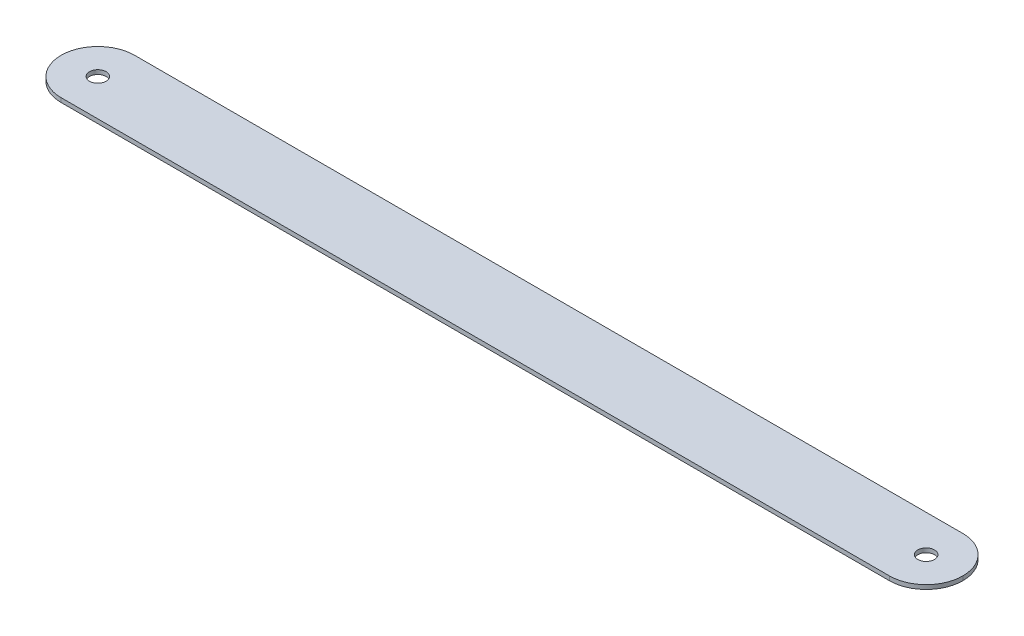
ISO-10303-21;
HEADER;
FILE_DESCRIPTION(('STEP AP214'),'2;1');
FILE_NAME('part.step','',(''),(''),'','','');
FILE_SCHEMA(('AUTOMOTIVE_DESIGN { 1 0 10303 214 1 1 1 1 }'));
ENDSEC;
DATA;
#1=APPLICATION_CONTEXT('core data for automotive mechanical design processes');
#2=APPLICATION_PROTOCOL_DEFINITION('international standard','automotive_design',2000,#1);
#3=PRODUCT_CONTEXT('',#1,'mechanical');
#4=PRODUCT('Part','Part','',(#3));
#5=PRODUCT_RELATED_PRODUCT_CATEGORY('part','',(#4));
#6=PRODUCT_DEFINITION_FORMATION('','',#4);
#7=PRODUCT_DEFINITION_CONTEXT('part definition',#1,'design');
#8=PRODUCT_DEFINITION('design','',#6,#7);
#9=PRODUCT_DEFINITION_SHAPE('','',#8);
#10=(LENGTH_UNIT() NAMED_UNIT(*) SI_UNIT(.MILLI.,.METRE.));
#11=(NAMED_UNIT(*) PLANE_ANGLE_UNIT() SI_UNIT($,.RADIAN.));
#12=(NAMED_UNIT(*) SI_UNIT($,.STERADIAN.) SOLID_ANGLE_UNIT());
#13=UNCERTAINTY_MEASURE_WITH_UNIT(LENGTH_MEASURE(1.E-05),#10,'distance_accuracy_value','');
#14=(GEOMETRIC_REPRESENTATION_CONTEXT(3) GLOBAL_UNCERTAINTY_ASSIGNED_CONTEXT((#13)) GLOBAL_UNIT_ASSIGNED_CONTEXT((#10,
#11,#12)) REPRESENTATION_CONTEXT('',''));
#15=CARTESIAN_POINT('',(0.,0.,0.));
#16=DIRECTION('',(0.,0.,1.));
#17=DIRECTION('',(1.,0.,0.));
#18=AXIS2_PLACEMENT_3D('',#15,#16,#17);
#19=CARTESIAN_POINT('',(92.075,-0.86,-7.50000000000001));
#20=DIRECTION('',(0.,0.,-1.));
#21=DIRECTION('',(-1.,0.,0.));
#22=AXIS2_PLACEMENT_3D('',#19,#20,#21);
#23=PLANE('',#22);
#24=DIRECTION('',(-1.,0.,0.));
#25=VECTOR('',#24,1.);
#26=CARTESIAN_POINT('',(92.075,0.,-7.50000000000001));
#27=LINE('',#26,#25);
#28=CARTESIAN_POINT('',(84.575,0.,-7.50000000000001));
#29=VERTEX_POINT('',#28);
#30=CARTESIAN_POINT('',(-84.575,0.,-7.49999999999999));
#31=VERTEX_POINT('',#30);
#32=EDGE_CURVE('E112',#29,#31,#27,.T.);
#33=ORIENTED_EDGE('',*,*,#32,.F.);
#34=DIRECTION('',(0.,1.,0.));
#35=VECTOR('',#34,1.);
#36=CARTESIAN_POINT('',(84.575,-0.86,-7.50000000000001));
#37=LINE('',#36,#35);
#38=CARTESIAN_POINT('',(84.575,-0.86,-7.50000000000001));
#39=VERTEX_POINT('',#38);
#40=EDGE_CURVE('E11',#29,#39,#37,.F.);
#41=ORIENTED_EDGE('',*,*,#40,.T.);
#42=DIRECTION('',(-1.,0.,0.));
#43=VECTOR('',#42,1.);
#44=CARTESIAN_POINT('',(92.075,-0.86,-7.50000000000001));
#45=LINE('',#44,#43);
#46=CARTESIAN_POINT('',(-84.575,-0.86,-7.49999999999999));
#47=VERTEX_POINT('',#46);
#48=EDGE_CURVE('E117',#39,#47,#45,.T.);
#49=ORIENTED_EDGE('',*,*,#48,.T.);
#50=DIRECTION('',(0.,1.,0.));
#51=VECTOR('',#50,1.);
#52=CARTESIAN_POINT('',(-84.575,-0.86,-7.49999999999999));
#53=LINE('',#52,#51);
#54=EDGE_CURVE('E45',#47,#31,#53,.T.);
#55=ORIENTED_EDGE('',*,*,#54,.T.);
#56=EDGE_LOOP('',(#33,#41,#49,#55));
#57=FACE_BOUND('',#56,.T.);
#58=ADVANCED_FACE('F36',(#57),#23,.T.);
#59=CARTESIAN_POINT('',(92.075,-0.86,7.49999999999999));
#60=DIRECTION('',(0.,0.,1.));
#61=DIRECTION('',(1.,0.,0.));
#62=AXIS2_PLACEMENT_3D('',#59,#60,#61);
#63=PLANE('',#62);
#64=DIRECTION('',(1.,0.,0.));
#65=VECTOR('',#64,1.);
#66=CARTESIAN_POINT('',(92.075,-0.86,7.49999999999999));
#67=LINE('',#66,#65);
#68=CARTESIAN_POINT('',(-84.5749999999999,-0.86,7.50000000000001));
#69=VERTEX_POINT('',#68);
#70=CARTESIAN_POINT('',(84.575,-0.86,7.49999999999999));
#71=VERTEX_POINT('',#70);
#72=EDGE_CURVE('E120',#69,#71,#67,.T.);
#73=ORIENTED_EDGE('',*,*,#72,.T.);
#74=DIRECTION('',(0.,1.,0.));
#75=VECTOR('',#74,1.);
#76=CARTESIAN_POINT('',(84.575,-0.86,7.49999999999999));
#77=LINE('',#76,#75);
#78=CARTESIAN_POINT('',(84.575,0.,7.49999999999999));
#79=VERTEX_POINT('',#78);
#80=EDGE_CURVE('E111',#71,#79,#77,.T.);
#81=ORIENTED_EDGE('',*,*,#80,.T.);
#82=DIRECTION('',(1.,0.,0.));
#83=VECTOR('',#82,1.);
#84=CARTESIAN_POINT('',(92.075,0.,7.49999999999999));
#85=LINE('',#84,#83);
#86=CARTESIAN_POINT('',(-84.5749999999999,0.,7.50000000000001));
#87=VERTEX_POINT('',#86);
#88=EDGE_CURVE('E93',#87,#79,#85,.T.);
#89=ORIENTED_EDGE('',*,*,#88,.F.);
#90=DIRECTION('',(0.,1.,0.));
#91=VECTOR('',#90,1.);
#92=CARTESIAN_POINT('',(-84.575,-0.86,7.50000000000001));
#93=LINE('',#92,#91);
#94=EDGE_CURVE('E108',#87,#69,#93,.F.);
#95=ORIENTED_EDGE('',*,*,#94,.T.);
#96=EDGE_LOOP('',(#73,#81,#89,#95));
#97=FACE_BOUND('',#96,.T.);
#98=ADVANCED_FACE('F107',(#97),#63,.T.);
#99=CARTESIAN_POINT('',(0.,-0.86,0.));
#100=DIRECTION('',(0.,1.,0.));
#101=DIRECTION('',(0.,0.,1.));
#102=AXIS2_PLACEMENT_3D('',#99,#100,#101);
#103=PLANE('',#102);
#104=CARTESIAN_POINT('',(-84.575,-0.86,0.));
#105=DIRECTION('',(0.,1.,0.));
#106=DIRECTION('',(0.,0.,1.));
#107=AXIS2_PLACEMENT_3D('',#104,#105,#106);
#108=CIRCLE('',#107,1.69999999999999);
#109=CARTESIAN_POINT('',(-84.575,-0.86,1.69999999999999));
#110=VERTEX_POINT('',#109);
#111=EDGE_CURVE('E139',#110,#110,#108,.T.);
#112=ORIENTED_EDGE('',*,*,#111,.T.);
#113=EDGE_LOOP('',(#112));
#114=FACE_BOUND('',#113,.T.);
#115=CARTESIAN_POINT('',(84.575,-0.86,0.));
#116=DIRECTION('',(0.,1.,0.));
#117=DIRECTION('',(0.,0.,1.));
#118=AXIS2_PLACEMENT_3D('',#115,#116,#117);
#119=CIRCLE('',#118,1.69999999999999);
#120=CARTESIAN_POINT('',(84.575,-0.86,1.69999999999999));
#121=VERTEX_POINT('',#120);
#122=EDGE_CURVE('E113',#121,#121,#119,.T.);
#123=ORIENTED_EDGE('',*,*,#122,.T.);
#124=EDGE_LOOP('',(#123));
#125=FACE_BOUND('',#124,.T.);
#126=CARTESIAN_POINT('',(84.575,-0.86,0.));
#127=DIRECTION('',(0.,1.,0.));
#128=DIRECTION('',(0.,0.,1.));
#129=AXIS2_PLACEMENT_3D('',#126,#127,#128);
#130=CIRCLE('',#129,7.5);
#131=CARTESIAN_POINT('',(92.075,-0.86,0.));
#132=VERTEX_POINT('',#131);
#133=EDGE_CURVE('E53',#39,#132,#130,.F.);
#134=ORIENTED_EDGE('',*,*,#133,.T.);
#135=CARTESIAN_POINT('',(84.575,-0.86,0.));
#136=DIRECTION('',(0.,1.,0.));
#137=DIRECTION('',(0.,0.,1.));
#138=AXIS2_PLACEMENT_3D('',#135,#136,#137);
#139=CIRCLE('',#138,7.5);
#140=EDGE_CURVE('E131',#132,#71,#139,.F.);
#141=ORIENTED_EDGE('',*,*,#140,.T.);
#142=ORIENTED_EDGE('',*,*,#72,.F.);
#143=CARTESIAN_POINT('',(-84.575,-0.86,0.));
#144=DIRECTION('',(0.,1.,0.));
#145=DIRECTION('',(0.,0.,1.));
#146=AXIS2_PLACEMENT_3D('',#143,#144,#145);
#147=CIRCLE('',#146,7.5);
#148=CARTESIAN_POINT('',(-92.075,-0.86,0.));
#149=VERTEX_POINT('',#148);
#150=EDGE_CURVE('E116',#69,#149,#147,.F.);
#151=ORIENTED_EDGE('',*,*,#150,.T.);
#152=CARTESIAN_POINT('',(-84.575,-0.86,0.));
#153=DIRECTION('',(0.,1.,0.));
#154=DIRECTION('',(0.,0.,1.));
#155=AXIS2_PLACEMENT_3D('',#152,#153,#154);
#156=CIRCLE('',#155,7.5);
#157=EDGE_CURVE('E59',#149,#47,#156,.F.);
#158=ORIENTED_EDGE('',*,*,#157,.T.);
#159=ORIENTED_EDGE('',*,*,#48,.F.);
#160=EDGE_LOOP('',(#134,#141,#142,#151,#158,#159));
#161=FACE_BOUND('',#160,.T.);
#162=ADVANCED_FACE('F157',(#114,#125,#161),#103,.F.);
#163=CARTESIAN_POINT('',(0.,0.,0.));
#164=DIRECTION('',(0.,1.,0.));
#165=DIRECTION('',(0.,0.,1.));
#166=AXIS2_PLACEMENT_3D('',#163,#164,#165);
#167=PLANE('',#166);
#168=CARTESIAN_POINT('',(-84.575,0.,0.));
#169=DIRECTION('',(0.,1.,0.));
#170=DIRECTION('',(0.,0.,1.));
#171=AXIS2_PLACEMENT_3D('',#168,#169,#170);
#172=CIRCLE('',#171,1.69999999999999);
#173=CARTESIAN_POINT('',(-84.575,0.,1.69999999999999));
#174=VERTEX_POINT('',#173);
#175=EDGE_CURVE('E135',#174,#174,#172,.T.);
#176=ORIENTED_EDGE('',*,*,#175,.F.);
#177=EDGE_LOOP('',(#176));
#178=FACE_BOUND('',#177,.T.);
#179=CARTESIAN_POINT('',(84.575,0.,0.));
#180=DIRECTION('',(0.,1.,0.));
#181=DIRECTION('',(0.,0.,1.));
#182=AXIS2_PLACEMENT_3D('',#179,#180,#181);
#183=CIRCLE('',#182,1.69999999999999);
#184=CARTESIAN_POINT('',(84.575,0.,1.69999999999999));
#185=VERTEX_POINT('',#184);
#186=EDGE_CURVE('E151',#185,#185,#183,.T.);
#187=ORIENTED_EDGE('',*,*,#186,.F.);
#188=EDGE_LOOP('',(#187));
#189=FACE_BOUND('',#188,.T.);
#190=ORIENTED_EDGE('',*,*,#88,.T.);
#191=CARTESIAN_POINT('',(84.575,0.,0.));
#192=DIRECTION('',(0.,1.,0.));
#193=DIRECTION('',(0.,0.,1.));
#194=AXIS2_PLACEMENT_3D('',#191,#192,#193);
#195=CIRCLE('',#194,7.5);
#196=CARTESIAN_POINT('',(92.075,0.,0.));
#197=VERTEX_POINT('',#196);
#198=EDGE_CURVE('E126',#79,#197,#195,.T.);
#199=ORIENTED_EDGE('',*,*,#198,.T.);
#200=CARTESIAN_POINT('',(84.575,0.,0.));
#201=DIRECTION('',(0.,1.,0.));
#202=DIRECTION('',(0.,0.,1.));
#203=AXIS2_PLACEMENT_3D('',#200,#201,#202);
#204=CIRCLE('',#203,7.5);
#205=EDGE_CURVE('E101',#197,#29,#204,.T.);
#206=ORIENTED_EDGE('',*,*,#205,.T.);
#207=ORIENTED_EDGE('',*,*,#32,.T.);
#208=CARTESIAN_POINT('',(-84.575,0.,0.));
#209=DIRECTION('',(0.,1.,0.));
#210=DIRECTION('',(0.,0.,1.));
#211=AXIS2_PLACEMENT_3D('',#208,#209,#210);
#212=CIRCLE('',#211,7.5);
#213=CARTESIAN_POINT('',(-92.075,0.,0.));
#214=VERTEX_POINT('',#213);
#215=EDGE_CURVE('E96',#31,#214,#212,.T.);
#216=ORIENTED_EDGE('',*,*,#215,.T.);
#217=CARTESIAN_POINT('',(-84.575,0.,0.));
#218=DIRECTION('',(0.,1.,0.));
#219=DIRECTION('',(0.,0.,1.));
#220=AXIS2_PLACEMENT_3D('',#217,#218,#219);
#221=CIRCLE('',#220,7.5);
#222=EDGE_CURVE('E90',#214,#87,#221,.T.);
#223=ORIENTED_EDGE('',*,*,#222,.T.);
#224=EDGE_LOOP('',(#190,#199,#206,#207,#216,#223));
#225=FACE_BOUND('',#224,.T.);
#226=ADVANCED_FACE('F92',(#178,#189,#225),#167,.T.);
#227=CARTESIAN_POINT('',(84.575,0.,0.));
#228=DIRECTION('',(0.,1.,0.));
#229=DIRECTION('',(0.,0.,1.));
#230=AXIS2_PLACEMENT_3D('',#227,#228,#229);
#231=CYLINDRICAL_SURFACE('',#230,1.69999999999999);
#232=ORIENTED_EDGE('',*,*,#186,.T.);
#233=EDGE_LOOP('',(#232));
#234=FACE_BOUND('',#233,.T.);
#235=ORIENTED_EDGE('',*,*,#122,.F.);
#236=EDGE_LOOP('',(#235));
#237=FACE_BOUND('',#236,.T.);
#238=ADVANCED_FACE('F163',(#234,#237),#231,.F.);
#239=CARTESIAN_POINT('',(-84.575,0.,0.));
#240=DIRECTION('',(0.,1.,0.));
#241=DIRECTION('',(0.,0.,1.));
#242=AXIS2_PLACEMENT_3D('',#239,#240,#241);
#243=CYLINDRICAL_SURFACE('',#242,1.69999999999999);
#244=ORIENTED_EDGE('',*,*,#175,.T.);
#245=EDGE_LOOP('',(#244));
#246=FACE_BOUND('',#245,.T.);
#247=ORIENTED_EDGE('',*,*,#111,.F.);
#248=EDGE_LOOP('',(#247));
#249=FACE_BOUND('',#248,.T.);
#250=ADVANCED_FACE('F160',(#246,#249),#243,.F.);
#251=CARTESIAN_POINT('',(84.575,-0.86,0.));
#252=DIRECTION('',(0.,1.,0.));
#253=DIRECTION('',(0.,0.,1.));
#254=AXIS2_PLACEMENT_3D('',#251,#252,#253);
#255=CYLINDRICAL_SURFACE('',#254,7.5);
#256=DIRECTION('',(0.,1.,0.));
#257=VECTOR('',#256,1.);
#258=CARTESIAN_POINT('',(92.075,-0.86,0.));
#259=LINE('',#258,#257);
#260=EDGE_CURVE('E133',#132,#197,#259,.T.);
#261=ORIENTED_EDGE('',*,*,#260,.F.);
#262=ORIENTED_EDGE('',*,*,#133,.F.);
#263=ORIENTED_EDGE('',*,*,#40,.F.);
#264=ORIENTED_EDGE('',*,*,#205,.F.);
#265=EDGE_LOOP('',(#261,#262,#263,#264));
#266=FACE_BOUND('',#265,.T.);
#267=ADVANCED_FACE('F162',(#266),#255,.T.);
#268=CARTESIAN_POINT('',(84.575,-0.86,0.));
#269=DIRECTION('',(0.,1.,0.));
#270=DIRECTION('',(0.,0.,1.));
#271=AXIS2_PLACEMENT_3D('',#268,#269,#270);
#272=CYLINDRICAL_SURFACE('',#271,7.5);
#273=ORIENTED_EDGE('',*,*,#140,.F.);
#274=ORIENTED_EDGE('',*,*,#260,.T.);
#275=ORIENTED_EDGE('',*,*,#198,.F.);
#276=ORIENTED_EDGE('',*,*,#80,.F.);
#277=EDGE_LOOP('',(#273,#274,#275,#276));
#278=FACE_BOUND('',#277,.T.);
#279=ADVANCED_FACE('F170',(#278),#272,.T.);
#280=CARTESIAN_POINT('',(-84.575,-0.86,0.));
#281=DIRECTION('',(0.,1.,0.));
#282=DIRECTION('',(0.,0.,1.));
#283=AXIS2_PLACEMENT_3D('',#280,#281,#282);
#284=CYLINDRICAL_SURFACE('',#283,7.5);
#285=ORIENTED_EDGE('',*,*,#54,.F.);
#286=ORIENTED_EDGE('',*,*,#157,.F.);
#287=DIRECTION('',(0.,1.,0.));
#288=VECTOR('',#287,1.);
#289=CARTESIAN_POINT('',(-92.075,-0.86,0.));
#290=LINE('',#289,#288);
#291=EDGE_CURVE('E40',#214,#149,#290,.F.);
#292=ORIENTED_EDGE('',*,*,#291,.F.);
#293=ORIENTED_EDGE('',*,*,#215,.F.);
#294=EDGE_LOOP('',(#285,#286,#292,#293));
#295=FACE_BOUND('',#294,.T.);
#296=ADVANCED_FACE('F38',(#295),#284,.T.);
#297=CARTESIAN_POINT('',(-84.575,-0.86,0.));
#298=DIRECTION('',(0.,1.,0.));
#299=DIRECTION('',(0.,0.,1.));
#300=AXIS2_PLACEMENT_3D('',#297,#298,#299);
#301=CYLINDRICAL_SURFACE('',#300,7.5);
#302=ORIENTED_EDGE('',*,*,#150,.F.);
#303=ORIENTED_EDGE('',*,*,#94,.F.);
#304=ORIENTED_EDGE('',*,*,#222,.F.);
#305=ORIENTED_EDGE('',*,*,#291,.T.);
#306=EDGE_LOOP('',(#302,#303,#304,#305));
#307=FACE_BOUND('',#306,.T.);
#308=ADVANCED_FACE('F115',(#307),#301,.T.);
#309=CLOSED_SHELL('',(#58,#98,#162,#226,#238,#250,#267,#279,#296,#308));
#310=MANIFOLD_SOLID_BREP('B2',#309);
#311=ADVANCED_BREP_SHAPE_REPRESENTATION('',(#18,#310),#14);
#312=SHAPE_DEFINITION_REPRESENTATION(#9,#311);
ENDSEC;
END-ISO-10303-21;
